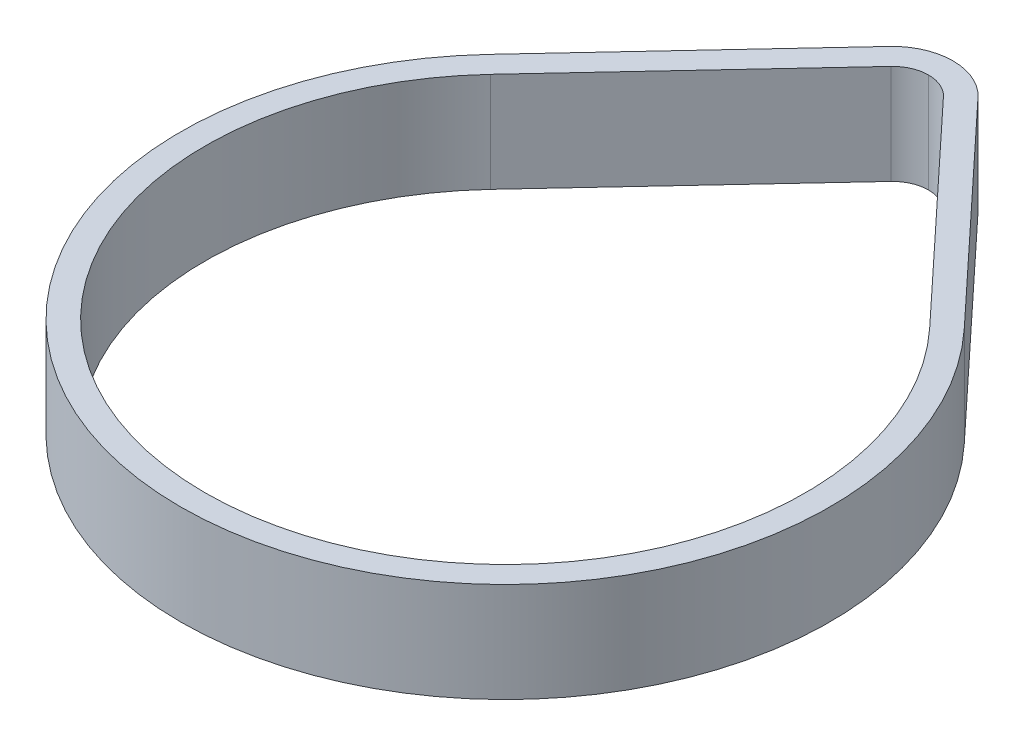
ISO-10303-21;
HEADER;
FILE_DESCRIPTION(('STEP AP214'),'2;1');
FILE_NAME('part.step','',(''),(''),'','','');
FILE_SCHEMA(('AUTOMOTIVE_DESIGN { 1 0 10303 214 1 1 1 1 }'));
ENDSEC;
DATA;
#1=APPLICATION_CONTEXT('core data for automotive mechanical design processes');
#2=APPLICATION_PROTOCOL_DEFINITION('international standard','automotive_design',2000,#1);
#3=PRODUCT_CONTEXT('',#1,'mechanical');
#4=PRODUCT('Part','Part','',(#3));
#5=PRODUCT_RELATED_PRODUCT_CATEGORY('part','',(#4));
#6=PRODUCT_DEFINITION_FORMATION('','',#4);
#7=PRODUCT_DEFINITION_CONTEXT('part definition',#1,'design');
#8=PRODUCT_DEFINITION('design','',#6,#7);
#9=PRODUCT_DEFINITION_SHAPE('','',#8);
#10=(LENGTH_UNIT() NAMED_UNIT(*) SI_UNIT(.MILLI.,.METRE.));
#11=(NAMED_UNIT(*) PLANE_ANGLE_UNIT() SI_UNIT($,.RADIAN.));
#12=(NAMED_UNIT(*) SI_UNIT($,.STERADIAN.) SOLID_ANGLE_UNIT());
#13=UNCERTAINTY_MEASURE_WITH_UNIT(LENGTH_MEASURE(1.E-05),#10,'distance_accuracy_value','');
#14=(GEOMETRIC_REPRESENTATION_CONTEXT(3) GLOBAL_UNCERTAINTY_ASSIGNED_CONTEXT((#13)) GLOBAL_UNIT_ASSIGNED_CONTEXT((#10,
#11,#12)) REPRESENTATION_CONTEXT('',''));
#15=CARTESIAN_POINT('',(0.,0.,0.));
#16=DIRECTION('',(0.,0.,1.));
#17=DIRECTION('',(1.,0.,0.));
#18=AXIS2_PLACEMENT_3D('',#15,#16,#17);
#19=CARTESIAN_POINT('',(3.95991909482378,7.5,-61.9987469807624));
#20=DIRECTION('',(-0.730916180367859,0.,0.682467242639864));
#21=DIRECTION('',(0.,1.,0.));
#22=AXIS2_PLACEMENT_3D('',#19,#20,#21);
#23=PLANE('',#22);
#24=DIRECTION('',(-0.682467242639864,0.,-0.730916180367859));
#25=VECTOR('',#24,1.);
#26=CARTESIAN_POINT('',(3.95991909482378,-7.5,-61.9987469807624));
#27=LINE('',#26,#25);
#28=CARTESIAN_POINT('',(33.0421497641391,-7.5,-30.8519436921978));
#29=VERTEX_POINT('',#28);
#30=CARTESIAN_POINT('',(3.95991909482379,-7.5,-61.9987469807624));
#31=VERTEX_POINT('',#30);
#32=EDGE_CURVE('E189',#29,#31,#27,.T.);
#33=ORIENTED_EDGE('',*,*,#32,.F.);
#34=DIRECTION('',(0.,-1.,0.));
#35=VECTOR('',#34,1.);
#36=CARTESIAN_POINT('',(33.0421497641391,7.5,-30.8519436921978));
#37=LINE('',#36,#35);
#38=CARTESIAN_POINT('',(33.0421497641391,7.5,-30.8519436921978));
#39=VERTEX_POINT('',#38);
#40=EDGE_CURVE('E11',#39,#29,#37,.T.);
#41=ORIENTED_EDGE('',*,*,#40,.F.);
#42=DIRECTION('',(-0.682467242639864,0.,-0.730916180367859));
#43=VECTOR('',#42,1.);
#44=CARTESIAN_POINT('',(3.95991909482378,7.5,-61.9987469807624));
#45=LINE('',#44,#43);
#46=CARTESIAN_POINT('',(3.95991909482378,7.5,-61.9987469807624));
#47=VERTEX_POINT('',#46);
#48=EDGE_CURVE('E143',#39,#47,#45,.T.);
#49=ORIENTED_EDGE('',*,*,#48,.T.);
#50=DIRECTION('',(0.,-1.,0.));
#51=VECTOR('',#50,1.);
#52=CARTESIAN_POINT('',(3.95991909482378,7.5,-61.9987469807624));
#53=LINE('',#52,#51);
#54=EDGE_CURVE('E168',#47,#31,#53,.T.);
#55=ORIENTED_EDGE('',*,*,#54,.T.);
#56=EDGE_LOOP('',(#33,#41,#49,#55));
#57=FACE_BOUND('',#56,.T.);
#58=ADVANCED_FACE('F16',(#57),#23,.T.);
#59=CARTESIAN_POINT('',(0.,7.5,0.));
#60=DIRECTION('',(0.,-1.,0.));
#61=DIRECTION('',(0.,0.,-1.));
#62=AXIS2_PLACEMENT_3D('',#59,#60,#61);
#63=CYLINDRICAL_SURFACE('',#62,45.2064828384418);
#64=CARTESIAN_POINT('',(0.,-7.5,0.));
#65=DIRECTION('',(0.,1.,0.));
#66=DIRECTION('',(1.,0.,0.));
#67=AXIS2_PLACEMENT_3D('',#64,#65,#66);
#68=CIRCLE('',#67,45.2064828384418);
#69=CARTESIAN_POINT('',(-33.0421497641391,-7.5,-30.8519436921978));
#70=VERTEX_POINT('',#69);
#71=EDGE_CURVE('E185',#70,#29,#68,.T.);
#72=ORIENTED_EDGE('',*,*,#71,.F.);
#73=DIRECTION('',(0.,-1.,0.));
#74=VECTOR('',#73,1.);
#75=CARTESIAN_POINT('',(-33.0421497641391,7.5,-30.8519436921978));
#76=LINE('',#75,#74);
#77=CARTESIAN_POINT('',(-33.0421497641391,7.5,-30.8519436921978));
#78=VERTEX_POINT('',#77);
#79=EDGE_CURVE('E27',#78,#70,#76,.T.);
#80=ORIENTED_EDGE('',*,*,#79,.F.);
#81=CARTESIAN_POINT('',(0.,7.5,0.));
#82=DIRECTION('',(0.,1.,0.));
#83=DIRECTION('',(1.,0.,0.));
#84=AXIS2_PLACEMENT_3D('',#81,#82,#83);
#85=CIRCLE('',#84,45.2064828384418);
#86=EDGE_CURVE('E140',#78,#39,#85,.T.);
#87=ORIENTED_EDGE('',*,*,#86,.T.);
#88=ORIENTED_EDGE('',*,*,#40,.T.);
#89=EDGE_LOOP('',(#72,#80,#87,#88));
#90=FACE_BOUND('',#89,.T.);
#91=ADVANCED_FACE('F268',(#90),#63,.F.);
#92=CARTESIAN_POINT('',(-3.95991909482379,7.5,-61.9987469807623));
#93=DIRECTION('',(0.730916180367859,0.,0.682467242639864));
#94=DIRECTION('',(0.,-1.,0.));
#95=AXIS2_PLACEMENT_3D('',#92,#93,#94);
#96=PLANE('',#95);
#97=DIRECTION('',(-0.682467242639864,0.,0.730916180367859));
#98=VECTOR('',#97,1.);
#99=CARTESIAN_POINT('',(-3.95991909482379,-7.5,-61.9987469807623));
#100=LINE('',#99,#98);
#101=CARTESIAN_POINT('',(-3.95991909482379,-7.5,-61.9987469807623));
#102=VERTEX_POINT('',#101);
#103=EDGE_CURVE('E20',#102,#70,#100,.T.);
#104=ORIENTED_EDGE('',*,*,#103,.F.);
#105=DIRECTION('',(0.,-1.,0.));
#106=VECTOR('',#105,1.);
#107=CARTESIAN_POINT('',(-3.95991909482379,7.5,-61.9987469807623));
#108=LINE('',#107,#106);
#109=CARTESIAN_POINT('',(-3.95991909482379,7.5,-61.9987469807623));
#110=VERTEX_POINT('',#109);
#111=EDGE_CURVE('E120',#110,#102,#108,.T.);
#112=ORIENTED_EDGE('',*,*,#111,.F.);
#113=DIRECTION('',(-0.682467242639864,0.,0.730916180367859));
#114=VECTOR('',#113,1.);
#115=CARTESIAN_POINT('',(-3.95991909482379,7.5,-61.9987469807623));
#116=LINE('',#115,#114);
#117=EDGE_CURVE('E146',#110,#78,#116,.T.);
#118=ORIENTED_EDGE('',*,*,#117,.T.);
#119=ORIENTED_EDGE('',*,*,#79,.T.);
#120=EDGE_LOOP('',(#104,#112,#118,#119));
#121=FACE_BOUND('',#120,.T.);
#122=ADVANCED_FACE('F271',(#121),#96,.T.);
#123=CARTESIAN_POINT('',(0.,7.5,-58.3013119830021));
#124=DIRECTION('',(0.,-1.,0.));
#125=DIRECTION('',(0.,0.,-1.));
#126=AXIS2_PLACEMENT_3D('',#123,#124,#125);
#127=CYLINDRICAL_SURFACE('',#126,5.41774720711591);
#128=DIRECTION('',(0.,-1.,0.));
#129=VECTOR('',#128,1.);
#130=CARTESIAN_POINT('',(0.,7.5,-63.719059190118));
#131=LINE('',#130,#129);
#132=CARTESIAN_POINT('',(0.,7.5,-63.719059190118));
#133=VERTEX_POINT('',#132);
#134=CARTESIAN_POINT('',(0.,-7.5,-63.719059190118));
#135=VERTEX_POINT('',#134);
#136=EDGE_CURVE('E169',#133,#135,#131,.T.);
#137=ORIENTED_EDGE('',*,*,#136,.F.);
#138=CARTESIAN_POINT('',(0.,7.5,-58.3013119830021));
#139=DIRECTION('',(0.,1.,0.));
#140=DIRECTION('',(1.,0.,0.));
#141=AXIS2_PLACEMENT_3D('',#138,#139,#140);
#142=CIRCLE('',#141,5.4177472071159);
#143=EDGE_CURVE('E150',#133,#110,#142,.T.);
#144=ORIENTED_EDGE('',*,*,#143,.T.);
#145=ORIENTED_EDGE('',*,*,#111,.T.);
#146=CARTESIAN_POINT('',(0.,-7.5,-58.3013119830021));
#147=DIRECTION('',(0.,1.,0.));
#148=DIRECTION('',(1.,0.,0.));
#149=AXIS2_PLACEMENT_3D('',#146,#147,#148);
#150=CIRCLE('',#149,5.4177472071159);
#151=EDGE_CURVE('E151',#135,#102,#150,.T.);
#152=ORIENTED_EDGE('',*,*,#151,.F.);
#153=EDGE_LOOP('',(#137,#144,#145,#152));
#154=FACE_BOUND('',#153,.T.);
#155=ADVANCED_FACE('F18',(#154),#127,.F.);
#156=CARTESIAN_POINT('',(6.65188338711861,7.5,-64.512273835405));
#157=DIRECTION('',(-0.730916180367859,0.,0.682467242639864));
#158=DIRECTION('',(0.,1.,0.));
#159=AXIS2_PLACEMENT_3D('',#156,#157,#158);
#160=PLANE('',#159);
#161=DIRECTION('',(-0.682467242639864,0.,-0.730916180367859));
#162=VECTOR('',#161,1.);
#163=CARTESIAN_POINT('',(6.65188338711861,-7.5,-64.512273835405));
#164=LINE('',#163,#162);
#165=CARTESIAN_POINT('',(35.7341140564339,-7.5,-33.3654705468403));
#166=VERTEX_POINT('',#165);
#167=CARTESIAN_POINT('',(6.65188338711861,-7.5,-64.512273835405));
#168=VERTEX_POINT('',#167);
#169=EDGE_CURVE('E112',#166,#168,#164,.T.);
#170=ORIENTED_EDGE('',*,*,#169,.T.);
#171=DIRECTION('',(0.,-1.,0.));
#172=VECTOR('',#171,1.);
#173=CARTESIAN_POINT('',(6.65188338711861,7.5,-64.512273835405));
#174=LINE('',#173,#172);
#175=CARTESIAN_POINT('',(6.65188338711861,7.5,-64.512273835405));
#176=VERTEX_POINT('',#175);
#177=EDGE_CURVE('E178',#176,#168,#174,.T.);
#178=ORIENTED_EDGE('',*,*,#177,.F.);
#179=DIRECTION('',(-0.682467242639864,0.,-0.730916180367859));
#180=VECTOR('',#179,1.);
#181=CARTESIAN_POINT('',(6.65188338711861,7.5,-64.512273835405));
#182=LINE('',#181,#180);
#183=CARTESIAN_POINT('',(35.7341140564339,7.5,-33.3654705468403));
#184=VERTEX_POINT('',#183);
#185=EDGE_CURVE('E115',#184,#176,#182,.T.);
#186=ORIENTED_EDGE('',*,*,#185,.F.);
#187=DIRECTION('',(0.,-1.,0.));
#188=VECTOR('',#187,1.);
#189=CARTESIAN_POINT('',(35.7341140564339,7.5,-33.3654705468403));
#190=LINE('',#189,#188);
#191=EDGE_CURVE('E108',#184,#166,#190,.T.);
#192=ORIENTED_EDGE('',*,*,#191,.T.);
#193=EDGE_LOOP('',(#170,#178,#186,#192));
#194=FACE_BOUND('',#193,.T.);
#195=ADVANCED_FACE('F110',(#194),#160,.F.);
#196=CARTESIAN_POINT('',(0.,7.5,0.));
#197=DIRECTION('',(0.,-1.,0.));
#198=DIRECTION('',(0.,0.,-1.));
#199=AXIS2_PLACEMENT_3D('',#196,#197,#198);
#200=CYLINDRICAL_SURFACE('',#199,48.8894828384418);
#201=CARTESIAN_POINT('',(0.,-7.5,0.));
#202=DIRECTION('',(0.,1.,0.));
#203=DIRECTION('',(1.,0.,0.));
#204=AXIS2_PLACEMENT_3D('',#201,#202,#203);
#205=CIRCLE('',#204,48.8894828384418);
#206=CARTESIAN_POINT('',(-35.7341140564339,-7.5,-33.3654705468403));
#207=VERTEX_POINT('',#206);
#208=EDGE_CURVE('E124',#207,#166,#205,.T.);
#209=ORIENTED_EDGE('',*,*,#208,.T.);
#210=ORIENTED_EDGE('',*,*,#191,.F.);
#211=CARTESIAN_POINT('',(0.,7.5,0.));
#212=DIRECTION('',(0.,1.,0.));
#213=DIRECTION('',(1.,0.,0.));
#214=AXIS2_PLACEMENT_3D('',#211,#212,#213);
#215=CIRCLE('',#214,48.8894828384418);
#216=CARTESIAN_POINT('',(-35.7341140564339,7.5,-33.3654705468403));
#217=VERTEX_POINT('',#216);
#218=EDGE_CURVE('E159',#217,#184,#215,.T.);
#219=ORIENTED_EDGE('',*,*,#218,.F.);
#220=DIRECTION('',(0.,-1.,0.));
#221=VECTOR('',#220,1.);
#222=CARTESIAN_POINT('',(-35.7341140564339,7.5,-33.3654705468403));
#223=LINE('',#222,#221);
#224=EDGE_CURVE('E121',#217,#207,#223,.T.);
#225=ORIENTED_EDGE('',*,*,#224,.T.);
#226=EDGE_LOOP('',(#209,#210,#219,#225));
#227=FACE_BOUND('',#226,.T.);
#228=ADVANCED_FACE('F125',(#227),#200,.T.);
#229=CARTESIAN_POINT('',(-6.65188338711861,7.5,-64.512273835405));
#230=DIRECTION('',(0.730916180367859,0.,0.682467242639865));
#231=DIRECTION('',(0.,-1.,0.));
#232=AXIS2_PLACEMENT_3D('',#229,#230,#231);
#233=PLANE('',#232);
#234=DIRECTION('',(-0.682467242639865,0.,0.730916180367859));
#235=VECTOR('',#234,1.);
#236=CARTESIAN_POINT('',(-6.65188338711861,-7.5,-64.512273835405));
#237=LINE('',#236,#235);
#238=CARTESIAN_POINT('',(-6.65188338711861,-7.5,-64.512273835405));
#239=VERTEX_POINT('',#238);
#240=EDGE_CURVE('E129',#239,#207,#237,.T.);
#241=ORIENTED_EDGE('',*,*,#240,.T.);
#242=ORIENTED_EDGE('',*,*,#224,.F.);
#243=DIRECTION('',(-0.682467242639865,0.,0.730916180367859));
#244=VECTOR('',#243,1.);
#245=CARTESIAN_POINT('',(-6.65188338711861,7.5,-64.512273835405));
#246=LINE('',#245,#244);
#247=CARTESIAN_POINT('',(-6.65188338711861,7.5,-64.512273835405));
#248=VERTEX_POINT('',#247);
#249=EDGE_CURVE('E155',#248,#217,#246,.T.);
#250=ORIENTED_EDGE('',*,*,#249,.F.);
#251=DIRECTION('',(0.,-1.,0.));
#252=VECTOR('',#251,1.);
#253=CARTESIAN_POINT('',(-6.65188338711861,7.5,-64.512273835405));
#254=LINE('',#253,#252);
#255=EDGE_CURVE('E163',#248,#239,#254,.T.);
#256=ORIENTED_EDGE('',*,*,#255,.T.);
#257=EDGE_LOOP('',(#241,#242,#250,#256));
#258=FACE_BOUND('',#257,.T.);
#259=ADVANCED_FACE('F393',(#258),#233,.F.);
#260=CARTESIAN_POINT('',(0.,7.5,-58.3013119830021));
#261=DIRECTION('',(0.,-1.,0.));
#262=DIRECTION('',(0.,0.,-1.));
#263=AXIS2_PLACEMENT_3D('',#260,#261,#262);
#264=CYLINDRICAL_SURFACE('',#263,9.1007472071159);
#265=DIRECTION('',(0.,-1.,0.));
#266=VECTOR('',#265,1.);
#267=CARTESIAN_POINT('',(0.,7.5,-67.402059190118));
#268=LINE('',#267,#266);
#269=CARTESIAN_POINT('',(0.,7.5,-67.402059190118));
#270=VERTEX_POINT('',#269);
#271=CARTESIAN_POINT('',(0.,-7.5,-67.402059190118));
#272=VERTEX_POINT('',#271);
#273=EDGE_CURVE('E170',#270,#272,#268,.T.);
#274=ORIENTED_EDGE('',*,*,#273,.F.);
#275=CARTESIAN_POINT('',(0.,7.5,-58.3013119830021));
#276=DIRECTION('',(0.,1.,0.));
#277=DIRECTION('',(1.,0.,0.));
#278=AXIS2_PLACEMENT_3D('',#275,#276,#277);
#279=CIRCLE('',#278,9.1007472071159);
#280=EDGE_CURVE('E160',#176,#270,#279,.T.);
#281=ORIENTED_EDGE('',*,*,#280,.F.);
#282=ORIENTED_EDGE('',*,*,#177,.T.);
#283=CARTESIAN_POINT('',(0.,-7.5,-58.3013119830021));
#284=DIRECTION('',(0.,1.,0.));
#285=DIRECTION('',(1.,0.,0.));
#286=AXIS2_PLACEMENT_3D('',#283,#284,#285);
#287=CIRCLE('',#286,9.1007472071159);
#288=EDGE_CURVE('E133',#168,#272,#287,.T.);
#289=ORIENTED_EDGE('',*,*,#288,.T.);
#290=EDGE_LOOP('',(#274,#281,#282,#289));
#291=FACE_BOUND('',#290,.T.);
#292=ADVANCED_FACE('F254',(#291),#264,.T.);
#293=CARTESIAN_POINT('',(0.,-7.5,-58.3013119830021));
#294=DIRECTION('',(0.,1.,0.));
#295=DIRECTION('',(1.,0.,0.));
#296=AXIS2_PLACEMENT_3D('',#293,#294,#295);
#297=PLANE('',#296);
#298=CARTESIAN_POINT('',(0.,-7.5,-58.3013119830021));
#299=DIRECTION('',(0.,1.,0.));
#300=DIRECTION('',(1.,0.,0.));
#301=AXIS2_PLACEMENT_3D('',#298,#299,#300);
#302=CIRCLE('',#301,5.4177472071159);
#303=EDGE_CURVE('E164',#31,#135,#302,.T.);
#304=ORIENTED_EDGE('',*,*,#303,.T.);
#305=ORIENTED_EDGE('',*,*,#151,.T.);
#306=ORIENTED_EDGE('',*,*,#103,.T.);
#307=ORIENTED_EDGE('',*,*,#71,.T.);
#308=ORIENTED_EDGE('',*,*,#32,.T.);
#309=EDGE_LOOP('',(#304,#305,#306,#307,#308));
#310=FACE_BOUND('',#309,.T.);
#311=ORIENTED_EDGE('',*,*,#288,.F.);
#312=ORIENTED_EDGE('',*,*,#169,.F.);
#313=ORIENTED_EDGE('',*,*,#208,.F.);
#314=ORIENTED_EDGE('',*,*,#240,.F.);
#315=CARTESIAN_POINT('',(0.,-7.5,-58.3013119830021));
#316=DIRECTION('',(0.,1.,0.));
#317=DIRECTION('',(1.,0.,0.));
#318=AXIS2_PLACEMENT_3D('',#315,#316,#317);
#319=CIRCLE('',#318,9.1007472071159);
#320=EDGE_CURVE('E174',#272,#239,#319,.T.);
#321=ORIENTED_EDGE('',*,*,#320,.F.);
#322=EDGE_LOOP('',(#311,#312,#313,#314,#321));
#323=FACE_BOUND('',#322,.T.);
#324=ADVANCED_FACE('F131',(#310,#323),#297,.F.);
#325=CARTESIAN_POINT('',(0.,7.5,-58.3013119830021));
#326=DIRECTION('',(0.,1.,0.));
#327=DIRECTION('',(1.,0.,0.));
#328=AXIS2_PLACEMENT_3D('',#325,#326,#327);
#329=PLANE('',#328);
#330=ORIENTED_EDGE('',*,*,#117,.F.);
#331=ORIENTED_EDGE('',*,*,#143,.F.);
#332=CARTESIAN_POINT('',(0.,7.5,-58.3013119830021));
#333=DIRECTION('',(0.,1.,0.));
#334=DIRECTION('',(1.,0.,0.));
#335=AXIS2_PLACEMENT_3D('',#332,#333,#334);
#336=CIRCLE('',#335,5.4177472071159);
#337=EDGE_CURVE('E182',#47,#133,#336,.T.);
#338=ORIENTED_EDGE('',*,*,#337,.F.);
#339=ORIENTED_EDGE('',*,*,#48,.F.);
#340=ORIENTED_EDGE('',*,*,#86,.F.);
#341=EDGE_LOOP('',(#330,#331,#338,#339,#340));
#342=FACE_BOUND('',#341,.T.);
#343=ORIENTED_EDGE('',*,*,#280,.T.);
#344=CARTESIAN_POINT('',(0.,7.5,-58.3013119830021));
#345=DIRECTION('',(0.,1.,0.));
#346=DIRECTION('',(1.,0.,0.));
#347=AXIS2_PLACEMENT_3D('',#344,#345,#346);
#348=CIRCLE('',#347,9.1007472071159);
#349=EDGE_CURVE('E175',#270,#248,#348,.T.);
#350=ORIENTED_EDGE('',*,*,#349,.T.);
#351=ORIENTED_EDGE('',*,*,#249,.T.);
#352=ORIENTED_EDGE('',*,*,#218,.T.);
#353=ORIENTED_EDGE('',*,*,#185,.T.);
#354=EDGE_LOOP('',(#343,#350,#351,#352,#353));
#355=FACE_BOUND('',#354,.T.);
#356=ADVANCED_FACE('F226',(#342,#355),#329,.T.);
#357=CARTESIAN_POINT('',(0.,7.5,-58.3013119830021));
#358=DIRECTION('',(0.,-1.,0.));
#359=DIRECTION('',(0.,0.,-1.));
#360=AXIS2_PLACEMENT_3D('',#357,#358,#359);
#361=CYLINDRICAL_SURFACE('',#360,9.1007472071159);
#362=ORIENTED_EDGE('',*,*,#349,.F.);
#363=ORIENTED_EDGE('',*,*,#273,.T.);
#364=ORIENTED_EDGE('',*,*,#320,.T.);
#365=ORIENTED_EDGE('',*,*,#255,.F.);
#366=EDGE_LOOP('',(#362,#363,#364,#365));
#367=FACE_BOUND('',#366,.T.);
#368=ADVANCED_FACE('F258',(#367),#361,.T.);
#369=CARTESIAN_POINT('',(0.,7.5,-58.3013119830021));
#370=DIRECTION('',(0.,-1.,0.));
#371=DIRECTION('',(0.,0.,-1.));
#372=AXIS2_PLACEMENT_3D('',#369,#370,#371);
#373=CYLINDRICAL_SURFACE('',#372,5.41774720711591);
#374=ORIENTED_EDGE('',*,*,#337,.T.);
#375=ORIENTED_EDGE('',*,*,#136,.T.);
#376=ORIENTED_EDGE('',*,*,#303,.F.);
#377=ORIENTED_EDGE('',*,*,#54,.F.);
#378=EDGE_LOOP('',(#374,#375,#376,#377));
#379=FACE_BOUND('',#378,.T.);
#380=ADVANCED_FACE('F214',(#379),#373,.F.);
#381=CLOSED_SHELL('',(#58,#91,#122,#155,#195,#228,#259,#292,#324,#356,#368,#380));
#382=MANIFOLD_SOLID_BREP('B1',#381);
#383=ADVANCED_BREP_SHAPE_REPRESENTATION('',(#18,#382),#14);
#384=SHAPE_DEFINITION_REPRESENTATION(#9,#383);
ENDSEC;
END-ISO-10303-21;
